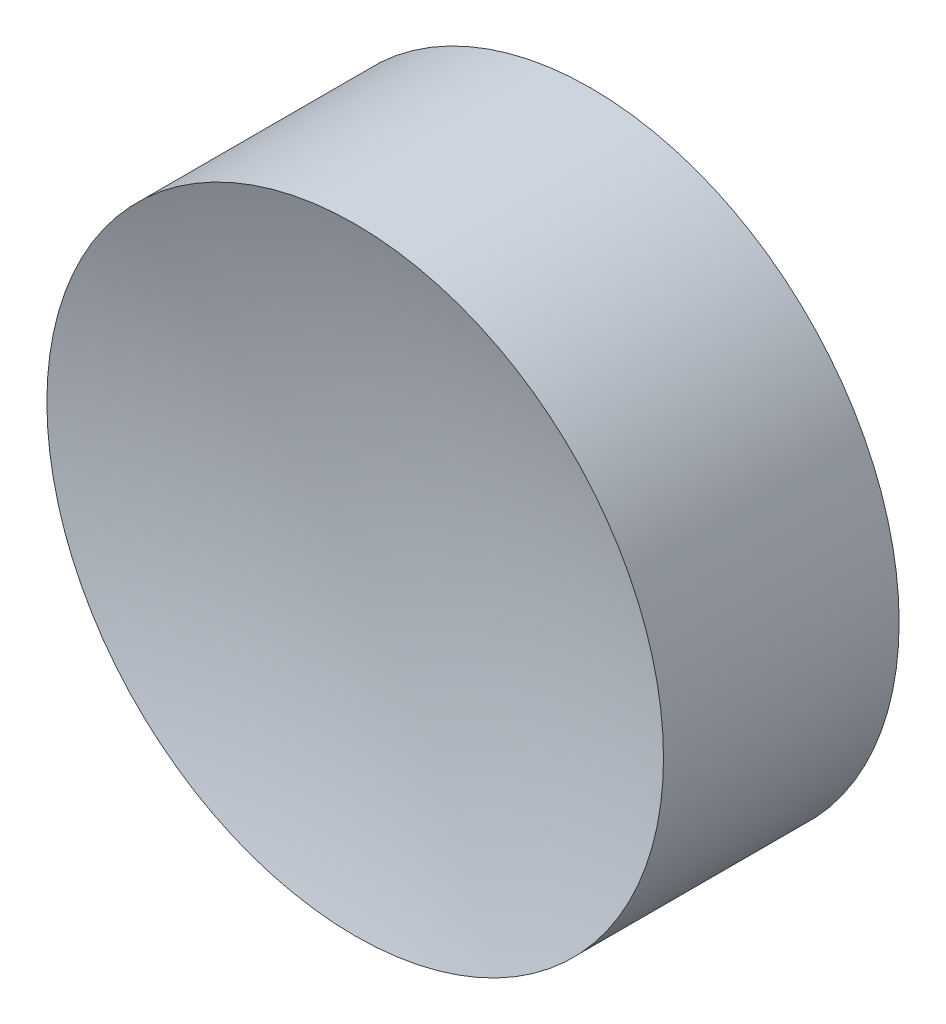
ISO-10303-21;
HEADER;
FILE_DESCRIPTION(('STEP AP214'),'2;1');
FILE_NAME('part.step','',(''),(''),'','','');
FILE_SCHEMA(('AUTOMOTIVE_DESIGN { 1 0 10303 214 1 1 1 1 }'));
ENDSEC;
DATA;
#1=APPLICATION_CONTEXT('core data for automotive mechanical design processes');
#2=APPLICATION_PROTOCOL_DEFINITION('international standard','automotive_design',2000,#1);
#3=PRODUCT_CONTEXT('',#1,'mechanical');
#4=PRODUCT('Part','Part','',(#3));
#5=PRODUCT_RELATED_PRODUCT_CATEGORY('part','',(#4));
#6=PRODUCT_DEFINITION_FORMATION('','',#4);
#7=PRODUCT_DEFINITION_CONTEXT('part definition',#1,'design');
#8=PRODUCT_DEFINITION('design','',#6,#7);
#9=PRODUCT_DEFINITION_SHAPE('','',#8);
#10=(LENGTH_UNIT() NAMED_UNIT(*) SI_UNIT(.MILLI.,.METRE.));
#11=(NAMED_UNIT(*) PLANE_ANGLE_UNIT() SI_UNIT($,.RADIAN.));
#12=(NAMED_UNIT(*) SI_UNIT($,.STERADIAN.) SOLID_ANGLE_UNIT());
#13=UNCERTAINTY_MEASURE_WITH_UNIT(LENGTH_MEASURE(1.E-05),#10,'distance_accuracy_value','');
#14=(GEOMETRIC_REPRESENTATION_CONTEXT(3) GLOBAL_UNCERTAINTY_ASSIGNED_CONTEXT((#13)) GLOBAL_UNIT_ASSIGNED_CONTEXT((#10,
#11,#12)) REPRESENTATION_CONTEXT('',''));
#15=CARTESIAN_POINT('',(0.,0.,0.));
#16=DIRECTION('',(0.,0.,1.));
#17=DIRECTION('',(1.,0.,0.));
#18=AXIS2_PLACEMENT_3D('',#15,#16,#17);
#19=CARTESIAN_POINT('',(0.,0.,-15.43));
#20=DIRECTION('',(0.,0.,1.));
#21=DIRECTION('',(0.,-1.,0.));
#22=AXIS2_PLACEMENT_3D('',#19,#20,#21);
#23=SPHERICAL_SURFACE('',#22,14.43);
#24=CARTESIAN_POINT('',(0.,0.,-1.71960613257227));
#25=DIRECTION('',(0.,0.,1.));
#26=DIRECTION('',(1.,0.,0.));
#27=AXIS2_PLACEMENT_3D('',#24,#25,#26);
#28=CIRCLE('',#27,4.5);
#29=CARTESIAN_POINT('',(4.5,0.,-1.71960613257227));
#30=VERTEX_POINT('',#29);
#31=EDGE_CURVE('E20',#30,#30,#28,.T.);
#32=ORIENTED_EDGE('',*,*,#31,.F.);
#33=EDGE_LOOP('',(#32));
#34=FACE_BOUND('',#33,.T.);
#35=ADVANCED_FACE('F13',(#34),#23,.F.);
#36=CARTESIAN_POINT('',(0.,0.,15.43));
#37=DIRECTION('',(0.,0.,1.));
#38=DIRECTION('',(0.,1.,0.));
#39=AXIS2_PLACEMENT_3D('',#36,#37,#38);
#40=SPHERICAL_SURFACE('',#39,14.43);
#41=CARTESIAN_POINT('',(0.,0.,1.71960613257227));
#42=DIRECTION('',(0.,0.,1.));
#43=DIRECTION('',(1.,0.,0.));
#44=AXIS2_PLACEMENT_3D('',#41,#42,#43);
#45=CIRCLE('',#44,4.5);
#46=CARTESIAN_POINT('',(4.5,0.,1.71960613257227));
#47=VERTEX_POINT('',#46);
#48=EDGE_CURVE('E9',#47,#47,#45,.T.);
#49=ORIENTED_EDGE('',*,*,#48,.T.);
#50=EDGE_LOOP('',(#49));
#51=FACE_BOUND('',#50,.T.);
#52=ADVANCED_FACE('F31',(#51),#40,.F.);
#53=CARTESIAN_POINT('',(0.,0.,4.07235358985976));
#54=DIRECTION('',(0.,0.,1.));
#55=DIRECTION('',(1.,0.,0.));
#56=AXIS2_PLACEMENT_3D('',#53,#54,#55);
#57=CYLINDRICAL_SURFACE('',#56,4.5);
#58=ORIENTED_EDGE('',*,*,#48,.F.);
#59=EDGE_LOOP('',(#58));
#60=FACE_BOUND('',#59,.T.);
#61=ORIENTED_EDGE('',*,*,#31,.T.);
#62=EDGE_LOOP('',(#61));
#63=FACE_BOUND('',#62,.T.);
#64=ADVANCED_FACE('F28',(#60,#63),#57,.T.);
#65=CLOSED_SHELL('',(#35,#52,#64));
#66=MANIFOLD_SOLID_BREP('B1',#65);
#67=ADVANCED_BREP_SHAPE_REPRESENTATION('',(#18,#66),#14);
#68=SHAPE_DEFINITION_REPRESENTATION(#9,#67);
ENDSEC;
END-ISO-10303-21;
